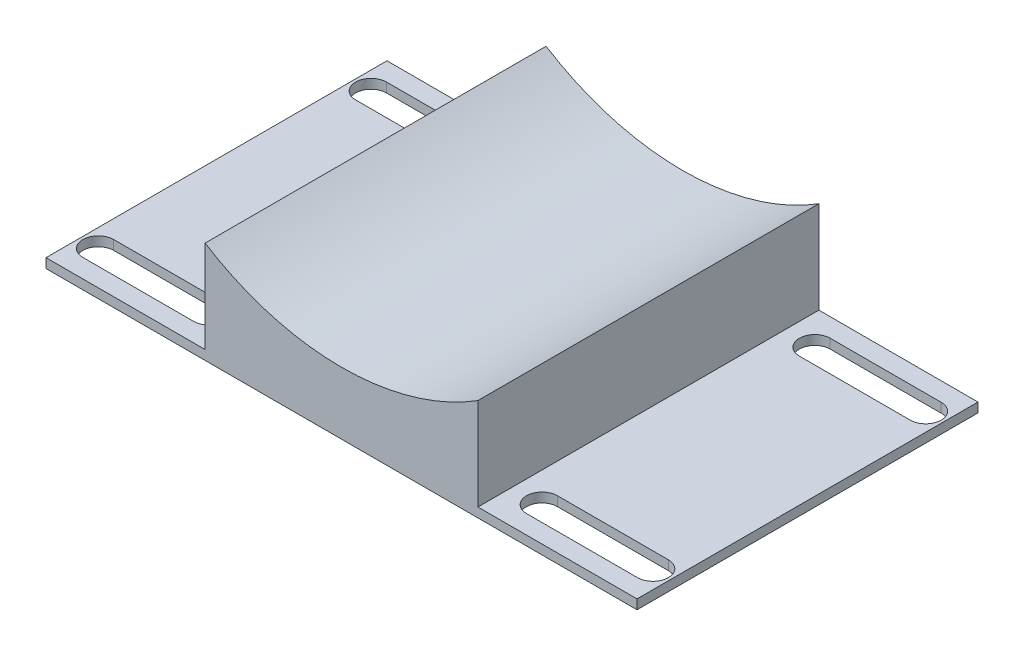
ISO-10303-21;
HEADER;
FILE_DESCRIPTION(('STEP AP214'),'2;1');
FILE_NAME('part.step','',(''),(''),'','','');
FILE_SCHEMA(('AUTOMOTIVE_DESIGN { 1 0 10303 214 1 1 1 1 }'));
ENDSEC;
DATA;
#1=APPLICATION_CONTEXT('core data for automotive mechanical design processes');
#2=APPLICATION_PROTOCOL_DEFINITION('international standard','automotive_design',2000,#1);
#3=PRODUCT_CONTEXT('',#1,'mechanical');
#4=PRODUCT('Part','Part','',(#3));
#5=PRODUCT_RELATED_PRODUCT_CATEGORY('part','',(#4));
#6=PRODUCT_DEFINITION_FORMATION('','',#4);
#7=PRODUCT_DEFINITION_CONTEXT('part definition',#1,'design');
#8=PRODUCT_DEFINITION('design','',#6,#7);
#9=PRODUCT_DEFINITION_SHAPE('','',#8);
#10=(LENGTH_UNIT() NAMED_UNIT(*) SI_UNIT(.MILLI.,.METRE.));
#11=(NAMED_UNIT(*) PLANE_ANGLE_UNIT() SI_UNIT($,.RADIAN.));
#12=(NAMED_UNIT(*) SI_UNIT($,.STERADIAN.) SOLID_ANGLE_UNIT());
#13=UNCERTAINTY_MEASURE_WITH_UNIT(LENGTH_MEASURE(1.E-05),#10,'distance_accuracy_value','');
#14=(GEOMETRIC_REPRESENTATION_CONTEXT(3) GLOBAL_UNCERTAINTY_ASSIGNED_CONTEXT((#13)) GLOBAL_UNIT_ASSIGNED_CONTEXT((#10,
#11,#12)) REPRESENTATION_CONTEXT('',''));
#15=CARTESIAN_POINT('',(0.,0.,0.));
#16=DIRECTION('',(0.,0.,1.));
#17=DIRECTION('',(1.,0.,0.));
#18=AXIS2_PLACEMENT_3D('',#15,#16,#17);
#19=CARTESIAN_POINT('',(38.1,1.32079999999999,95.25));
#20=DIRECTION('',(0.,-1.,0.));
#21=DIRECTION('',(1.,0.,0.));
#22=AXIS2_PLACEMENT_3D('',#19,#20,#21);
#23=PLANE('',#22);
#24=CARTESIAN_POINT('',(77.47,1.32079999999999,85.725));
#25=DIRECTION('',(0.,-1.,0.));
#26=DIRECTION('',(1.,0.,0.));
#27=AXIS2_PLACEMENT_3D('',#24,#25,#26);
#28=CIRCLE('',#27,4.31799999999999);
#29=CARTESIAN_POINT('',(77.47,1.32079999999999,81.4070000000001));
#30=VERTEX_POINT('',#29);
#31=CARTESIAN_POINT('',(77.47,1.32079999999999,90.043));
#32=VERTEX_POINT('',#31);
#33=EDGE_CURVE('E57',#30,#32,#28,.T.);
#34=ORIENTED_EDGE('',*,*,#33,.T.);
#35=DIRECTION('',(-1.,0.,0.));
#36=VECTOR('',#35,1.);
#37=CARTESIAN_POINT('',(77.47,1.32079999999999,90.043));
#38=LINE('',#37,#36);
#39=CARTESIAN_POINT('',(46.482,1.32079999999999,90.043));
#40=VERTEX_POINT('',#39);
#41=EDGE_CURVE('E233',#32,#40,#38,.T.);
#42=ORIENTED_EDGE('',*,*,#41,.T.);
#43=CARTESIAN_POINT('',(46.482,1.32079999999999,85.725));
#44=DIRECTION('',(0.,-1.,0.));
#45=DIRECTION('',(1.,0.,0.));
#46=AXIS2_PLACEMENT_3D('',#43,#44,#45);
#47=CIRCLE('',#46,4.31799999999999);
#48=CARTESIAN_POINT('',(46.482,1.32079999999999,81.4070000000001));
#49=VERTEX_POINT('',#48);
#50=EDGE_CURVE('E230',#40,#49,#47,.T.);
#51=ORIENTED_EDGE('',*,*,#50,.T.);
#52=DIRECTION('',(1.,0.,0.));
#53=VECTOR('',#52,1.);
#54=CARTESIAN_POINT('',(77.47,1.32079999999999,81.4070000000001));
#55=LINE('',#54,#53);
#56=EDGE_CURVE('E227',#49,#30,#55,.T.);
#57=ORIENTED_EDGE('',*,*,#56,.T.);
#58=EDGE_LOOP('',(#34,#42,#51,#57));
#59=FACE_BOUND('',#58,.T.);
#60=DIRECTION('',(-1.,0.,0.));
#61=VECTOR('',#60,1.);
#62=CARTESIAN_POINT('',(38.1,1.32079999999999,0.));
#63=LINE('',#62,#61);
#64=CARTESIAN_POINT('',(82.5499999999995,1.32079999999999,0.));
#65=VERTEX_POINT('',#64);
#66=CARTESIAN_POINT('',(38.1,1.32079999999999,0.));
#67=VERTEX_POINT('',#66);
#68=EDGE_CURVE('E305',#65,#67,#63,.T.);
#69=ORIENTED_EDGE('',*,*,#68,.T.);
#70=DIRECTION('',(0.,0.,-1.));
#71=VECTOR('',#70,1.);
#72=CARTESIAN_POINT('',(38.1,1.32079999999999,95.25));
#73=LINE('',#72,#71);
#74=CARTESIAN_POINT('',(38.1,1.32079999999999,95.25));
#75=VERTEX_POINT('',#74);
#76=EDGE_CURVE('E335',#75,#67,#73,.T.);
#77=ORIENTED_EDGE('',*,*,#76,.F.);
#78=DIRECTION('',(-1.,0.,0.));
#79=VECTOR('',#78,1.);
#80=CARTESIAN_POINT('',(38.1,1.32079999999999,95.25));
#81=LINE('',#80,#79);
#82=CARTESIAN_POINT('',(82.5499999999995,1.32079999999999,95.25));
#83=VERTEX_POINT('',#82);
#84=EDGE_CURVE('E287',#83,#75,#81,.T.);
#85=ORIENTED_EDGE('',*,*,#84,.F.);
#86=DIRECTION('',(0.,0.,-1.));
#87=VECTOR('',#86,1.);
#88=CARTESIAN_POINT('',(82.5499999999995,1.32079999999999,95.25));
#89=LINE('',#88,#87);
#90=EDGE_CURVE('E338',#83,#65,#89,.T.);
#91=ORIENTED_EDGE('',*,*,#90,.T.);
#92=EDGE_LOOP('',(#69,#77,#85,#91));
#93=FACE_BOUND('',#92,.T.);
#94=CARTESIAN_POINT('',(77.47,1.32079999999999,9.52500000000001));
#95=DIRECTION('',(0.,-1.,0.));
#96=DIRECTION('',(1.,0.,0.));
#97=AXIS2_PLACEMENT_3D('',#94,#95,#96);
#98=CIRCLE('',#97,4.318);
#99=CARTESIAN_POINT('',(77.47,1.32079999999999,5.20700000000002));
#100=VERTEX_POINT('',#99);
#101=CARTESIAN_POINT('',(77.47,1.32079999999999,13.843));
#102=VERTEX_POINT('',#101);
#103=EDGE_CURVE('E49',#100,#102,#98,.T.);
#104=ORIENTED_EDGE('',*,*,#103,.T.);
#105=DIRECTION('',(-1.,0.,0.));
#106=VECTOR('',#105,1.);
#107=CARTESIAN_POINT('',(77.47,1.32079999999999,13.843));
#108=LINE('',#107,#106);
#109=CARTESIAN_POINT('',(46.482,1.32079999999999,13.843));
#110=VERTEX_POINT('',#109);
#111=EDGE_CURVE('E216',#102,#110,#108,.T.);
#112=ORIENTED_EDGE('',*,*,#111,.T.);
#113=CARTESIAN_POINT('',(46.482,1.32079999999999,9.52500000000001));
#114=DIRECTION('',(0.,-1.,0.));
#115=DIRECTION('',(1.,0.,0.));
#116=AXIS2_PLACEMENT_3D('',#113,#114,#115);
#117=CIRCLE('',#116,4.318);
#118=CARTESIAN_POINT('',(46.482,1.32079999999999,5.20700000000001));
#119=VERTEX_POINT('',#118);
#120=EDGE_CURVE('E201',#110,#119,#117,.T.);
#121=ORIENTED_EDGE('',*,*,#120,.T.);
#122=DIRECTION('',(1.,0.,0.));
#123=VECTOR('',#122,1.);
#124=CARTESIAN_POINT('',(77.47,1.32079999999999,5.20700000000001));
#125=LINE('',#124,#123);
#126=EDGE_CURVE('E211',#119,#100,#125,.T.);
#127=ORIENTED_EDGE('',*,*,#126,.T.);
#128=EDGE_LOOP('',(#104,#112,#121,#127));
#129=FACE_BOUND('',#128,.T.);
#130=ADVANCED_FACE('F34',(#59,#93,#129),#23,.F.);
#131=CARTESIAN_POINT('',(-82.5500000000005,-1.32080000000001,95.25));
#132=DIRECTION('',(0.,1.,0.));
#133=DIRECTION('',(0.,0.,1.));
#134=AXIS2_PLACEMENT_3D('',#131,#132,#133);
#135=PLANE('',#134);
#136=CARTESIAN_POINT('',(77.47,-1.32080000000001,85.725));
#137=DIRECTION('',(0.,1.,0.));
#138=DIRECTION('',(0.,0.,1.));
#139=AXIS2_PLACEMENT_3D('',#136,#137,#138);
#140=CIRCLE('',#139,4.31799999999999);
#141=CARTESIAN_POINT('',(77.47,-1.32080000000001,81.4070000000001));
#142=VERTEX_POINT('',#141);
#143=CARTESIAN_POINT('',(77.47,-1.32080000000001,90.043));
#144=VERTEX_POINT('',#143);
#145=EDGE_CURVE('E372',#142,#144,#140,.F.);
#146=ORIENTED_EDGE('',*,*,#145,.F.);
#147=DIRECTION('',(1.,0.,0.));
#148=VECTOR('',#147,1.);
#149=CARTESIAN_POINT('',(-82.5500000000005,-1.32080000000001,81.4070000000001));
#150=LINE('',#149,#148);
#151=CARTESIAN_POINT('',(46.482,-1.32080000000001,81.4070000000001));
#152=VERTEX_POINT('',#151);
#153=EDGE_CURVE('E365',#152,#142,#150,.T.);
#154=ORIENTED_EDGE('',*,*,#153,.F.);
#155=CARTESIAN_POINT('',(46.482,-1.32080000000001,85.725));
#156=DIRECTION('',(0.,1.,0.));
#157=DIRECTION('',(0.,0.,1.));
#158=AXIS2_PLACEMENT_3D('',#155,#156,#157);
#159=CIRCLE('',#158,4.31799999999999);
#160=CARTESIAN_POINT('',(46.482,-1.32080000000001,90.043));
#161=VERTEX_POINT('',#160);
#162=EDGE_CURVE('E367',#161,#152,#159,.F.);
#163=ORIENTED_EDGE('',*,*,#162,.F.);
#164=DIRECTION('',(-1.,0.,0.));
#165=VECTOR('',#164,1.);
#166=CARTESIAN_POINT('',(-82.5500000000005,-1.32080000000001,90.043));
#167=LINE('',#166,#165);
#168=EDGE_CURVE('E370',#144,#161,#167,.T.);
#169=ORIENTED_EDGE('',*,*,#168,.F.);
#170=EDGE_LOOP('',(#146,#154,#163,#169));
#171=FACE_BOUND('',#170,.T.);
#172=DIRECTION('',(-1.,0.,0.));
#173=VECTOR('',#172,1.);
#174=CARTESIAN_POINT('',(-82.5500000000005,-1.32080000000001,5.20700000000002));
#175=LINE('',#174,#173);
#176=CARTESIAN_POINT('',(-46.482,-1.32080000000001,5.20700000000001));
#177=VERTEX_POINT('',#176);
#178=CARTESIAN_POINT('',(-77.47,-1.32080000000001,5.20700000000001));
#179=VERTEX_POINT('',#178);
#180=EDGE_CURVE('E359',#177,#179,#175,.T.);
#181=ORIENTED_EDGE('',*,*,#180,.T.);
#182=CARTESIAN_POINT('',(-77.47,-1.32080000000001,9.52500000000001));
#183=DIRECTION('',(0.,1.,0.));
#184=DIRECTION('',(0.,0.,1.));
#185=AXIS2_PLACEMENT_3D('',#182,#183,#184);
#186=CIRCLE('',#185,4.318);
#187=CARTESIAN_POINT('',(-77.47,-1.32080000000001,13.843));
#188=VERTEX_POINT('',#187);
#189=EDGE_CURVE('E362',#179,#188,#186,.T.);
#190=ORIENTED_EDGE('',*,*,#189,.T.);
#191=DIRECTION('',(1.,0.,0.));
#192=VECTOR('',#191,1.);
#193=CARTESIAN_POINT('',(-82.5500000000005,-1.32080000000001,13.843));
#194=LINE('',#193,#192);
#195=CARTESIAN_POINT('',(-46.482,-1.32080000000001,13.843));
#196=VERTEX_POINT('',#195);
#197=EDGE_CURVE('E353',#188,#196,#194,.T.);
#198=ORIENTED_EDGE('',*,*,#197,.T.);
#199=CARTESIAN_POINT('',(-46.482,-1.32080000000001,9.52500000000001));
#200=DIRECTION('',(0.,1.,0.));
#201=DIRECTION('',(0.,0.,1.));
#202=AXIS2_PLACEMENT_3D('',#199,#200,#201);
#203=CIRCLE('',#202,4.318);
#204=EDGE_CURVE('E356',#196,#177,#203,.T.);
#205=ORIENTED_EDGE('',*,*,#204,.T.);
#206=EDGE_LOOP('',(#181,#190,#198,#205));
#207=FACE_BOUND('',#206,.T.);
#208=DIRECTION('',(-1.,0.,0.));
#209=VECTOR('',#208,1.);
#210=CARTESIAN_POINT('',(-82.5500000000005,-1.32080000000001,81.4070000000001));
#211=LINE('',#210,#209);
#212=CARTESIAN_POINT('',(-46.482,-1.32080000000001,81.4070000000001));
#213=VERTEX_POINT('',#212);
#214=CARTESIAN_POINT('',(-77.47,-1.32080000000001,81.4070000000001));
#215=VERTEX_POINT('',#214);
#216=EDGE_CURVE('E347',#213,#215,#211,.T.);
#217=ORIENTED_EDGE('',*,*,#216,.T.);
#218=CARTESIAN_POINT('',(-77.47,-1.32080000000001,85.725));
#219=DIRECTION('',(0.,1.,0.));
#220=DIRECTION('',(0.,0.,1.));
#221=AXIS2_PLACEMENT_3D('',#218,#219,#220);
#222=CIRCLE('',#221,4.31799999999999);
#223=CARTESIAN_POINT('',(-77.47,-1.32080000000001,90.043));
#224=VERTEX_POINT('',#223);
#225=EDGE_CURVE('E350',#215,#224,#222,.T.);
#226=ORIENTED_EDGE('',*,*,#225,.T.);
#227=DIRECTION('',(1.,0.,0.));
#228=VECTOR('',#227,1.);
#229=CARTESIAN_POINT('',(-82.5500000000005,-1.32080000000001,90.043));
#230=LINE('',#229,#228);
#231=CARTESIAN_POINT('',(-46.482,-1.32080000000001,90.043));
#232=VERTEX_POINT('',#231);
#233=EDGE_CURVE('E341',#224,#232,#230,.T.);
#234=ORIENTED_EDGE('',*,*,#233,.T.);
#235=CARTESIAN_POINT('',(-46.482,-1.32080000000001,85.725));
#236=DIRECTION('',(0.,1.,0.));
#237=DIRECTION('',(0.,0.,1.));
#238=AXIS2_PLACEMENT_3D('',#235,#236,#237);
#239=CIRCLE('',#238,4.31799999999999);
#240=EDGE_CURVE('E344',#232,#213,#239,.T.);
#241=ORIENTED_EDGE('',*,*,#240,.T.);
#242=EDGE_LOOP('',(#217,#226,#234,#241));
#243=FACE_BOUND('',#242,.T.);
#244=DIRECTION('',(1.,0.,0.));
#245=VECTOR('',#244,1.);
#246=CARTESIAN_POINT('',(-82.5500000000005,-1.32080000000001,0.));
#247=LINE('',#246,#245);
#248=CARTESIAN_POINT('',(-82.5500000000005,-1.32080000000001,0.));
#249=VERTEX_POINT('',#248);
#250=CARTESIAN_POINT('',(82.5499999999995,-1.32080000000001,0.));
#251=VERTEX_POINT('',#250);
#252=EDGE_CURVE('E288',#249,#251,#247,.T.);
#253=ORIENTED_EDGE('',*,*,#252,.T.);
#254=DIRECTION('',(0.,0.,-1.));
#255=VECTOR('',#254,1.);
#256=CARTESIAN_POINT('',(82.5499999999995,-1.32080000000001,95.25));
#257=LINE('',#256,#255);
#258=CARTESIAN_POINT('',(82.5499999999995,-1.32080000000001,95.25));
#259=VERTEX_POINT('',#258);
#260=EDGE_CURVE('E302',#259,#251,#257,.T.);
#261=ORIENTED_EDGE('',*,*,#260,.F.);
#262=DIRECTION('',(1.,0.,0.));
#263=VECTOR('',#262,1.);
#264=CARTESIAN_POINT('',(-82.5500000000005,-1.32080000000001,95.25));
#265=LINE('',#264,#263);
#266=CARTESIAN_POINT('',(-82.5500000000005,-1.32080000000001,95.25));
#267=VERTEX_POINT('',#266);
#268=EDGE_CURVE('E300',#267,#259,#265,.T.);
#269=ORIENTED_EDGE('',*,*,#268,.F.);
#270=DIRECTION('',(0.,0.,-1.));
#271=VECTOR('',#270,1.);
#272=CARTESIAN_POINT('',(-82.5500000000005,-1.32080000000001,95.25));
#273=LINE('',#272,#271);
#274=EDGE_CURVE('E320',#267,#249,#273,.T.);
#275=ORIENTED_EDGE('',*,*,#274,.T.);
#276=EDGE_LOOP('',(#253,#261,#269,#275));
#277=FACE_BOUND('',#276,.T.);
#278=CARTESIAN_POINT('',(77.47,-1.32080000000001,9.52500000000001));
#279=DIRECTION('',(0.,1.,0.));
#280=DIRECTION('',(0.,0.,1.));
#281=AXIS2_PLACEMENT_3D('',#278,#279,#280);
#282=CIRCLE('',#281,4.318);
#283=CARTESIAN_POINT('',(77.47,-1.32080000000001,5.20700000000001));
#284=VERTEX_POINT('',#283);
#285=CARTESIAN_POINT('',(77.47,-1.32080000000001,13.843));
#286=VERTEX_POINT('',#285);
#287=EDGE_CURVE('E11',#284,#286,#282,.F.);
#288=ORIENTED_EDGE('',*,*,#287,.F.);
#289=DIRECTION('',(1.,0.,0.));
#290=VECTOR('',#289,1.);
#291=CARTESIAN_POINT('',(-82.5500000000004,-1.32080000000001,5.207));
#292=LINE('',#291,#290);
#293=CARTESIAN_POINT('',(46.482,-1.32080000000001,5.20700000000002));
#294=VERTEX_POINT('',#293);
#295=EDGE_CURVE('E374',#294,#284,#292,.T.);
#296=ORIENTED_EDGE('',*,*,#295,.F.);
#297=CARTESIAN_POINT('',(46.482,-1.32080000000001,9.52500000000001));
#298=DIRECTION('',(0.,1.,0.));
#299=DIRECTION('',(0.,0.,1.));
#300=AXIS2_PLACEMENT_3D('',#297,#298,#299);
#301=CIRCLE('',#300,4.318);
#302=CARTESIAN_POINT('',(46.482,-1.32080000000001,13.843));
#303=VERTEX_POINT('',#302);
#304=EDGE_CURVE('E204',#303,#294,#301,.F.);
#305=ORIENTED_EDGE('',*,*,#304,.F.);
#306=DIRECTION('',(-1.,0.,0.));
#307=VECTOR('',#306,1.);
#308=CARTESIAN_POINT('',(-82.5500000000004,-1.32080000000001,13.843));
#309=LINE('',#308,#307);
#310=EDGE_CURVE('E42',#286,#303,#309,.T.);
#311=ORIENTED_EDGE('',*,*,#310,.F.);
#312=EDGE_LOOP('',(#288,#296,#305,#311));
#313=FACE_BOUND('',#312,.T.);
#314=ADVANCED_FACE('F382',(#171,#207,#243,#277,#313),#135,.F.);
#315=CARTESIAN_POINT('',(82.5499999999995,1.32079999999999,95.25));
#316=DIRECTION('',(-1.,0.,0.));
#317=DIRECTION('',(0.,0.,1.));
#318=AXIS2_PLACEMENT_3D('',#315,#316,#317);
#319=PLANE('',#318);
#320=DIRECTION('',(0.,1.,0.));
#321=VECTOR('',#320,1.);
#322=CARTESIAN_POINT('',(82.5499999999995,1.32079999999999,0.));
#323=LINE('',#322,#321);
#324=EDGE_CURVE('E259',#251,#65,#323,.T.);
#325=ORIENTED_EDGE('',*,*,#324,.T.);
#326=ORIENTED_EDGE('',*,*,#90,.F.);
#327=DIRECTION('',(0.,1.,0.));
#328=VECTOR('',#327,1.);
#329=CARTESIAN_POINT('',(82.5499999999995,1.32079999999999,95.25));
#330=LINE('',#329,#328);
#331=EDGE_CURVE('E284',#259,#83,#330,.T.);
#332=ORIENTED_EDGE('',*,*,#331,.F.);
#333=ORIENTED_EDGE('',*,*,#260,.T.);
#334=EDGE_LOOP('',(#325,#326,#332,#333));
#335=FACE_BOUND('',#334,.T.);
#336=ADVANCED_FACE('F36',(#335),#319,.F.);
#337=CARTESIAN_POINT('',(38.1,27.0747951934076,95.25));
#338=DIRECTION('',(-1.,0.,0.));
#339=DIRECTION('',(0.,-1.,0.));
#340=AXIS2_PLACEMENT_3D('',#337,#338,#339);
#341=PLANE('',#340);
#342=DIRECTION('',(0.,1.,0.));
#343=VECTOR('',#342,1.);
#344=CARTESIAN_POINT('',(38.1,27.0747951934076,0.));
#345=LINE('',#344,#343);
#346=CARTESIAN_POINT('',(38.1,27.0747951934076,0.));
#347=VERTEX_POINT('',#346);
#348=EDGE_CURVE('E307',#67,#347,#345,.T.);
#349=ORIENTED_EDGE('',*,*,#348,.T.);
#350=DIRECTION('',(0.,0.,-1.));
#351=VECTOR('',#350,1.);
#352=CARTESIAN_POINT('',(38.1,27.0747951934076,95.25));
#353=LINE('',#352,#351);
#354=CARTESIAN_POINT('',(38.1,27.0747951934076,95.25));
#355=VERTEX_POINT('',#354);
#356=EDGE_CURVE('E332',#355,#347,#353,.T.);
#357=ORIENTED_EDGE('',*,*,#356,.F.);
#358=DIRECTION('',(0.,1.,0.));
#359=VECTOR('',#358,1.);
#360=CARTESIAN_POINT('',(38.1,27.0747951934076,95.25));
#361=LINE('',#360,#359);
#362=EDGE_CURVE('E290',#75,#355,#361,.T.);
#363=ORIENTED_EDGE('',*,*,#362,.F.);
#364=ORIENTED_EDGE('',*,*,#76,.T.);
#365=EDGE_LOOP('',(#349,#357,#363,#364));
#366=FACE_BOUND('',#365,.T.);
#367=ADVANCED_FACE('F406',(#366),#341,.F.);
#368=CARTESIAN_POINT('',(0.,87.5792,95.25));
#369=DIRECTION('',(0.,0.,-1.));
#370=DIRECTION('',(-1.,0.,0.));
#371=AXIS2_PLACEMENT_3D('',#368,#369,#370);
#372=CYLINDRICAL_SURFACE('',#371,71.501);
#373=CARTESIAN_POINT('',(0.,87.5792,0.));
#374=DIRECTION('',(0.,0.,-1.));
#375=DIRECTION('',(1.,0.,0.));
#376=AXIS2_PLACEMENT_3D('',#373,#374,#375);
#377=CIRCLE('',#376,71.501);
#378=CARTESIAN_POINT('',(-38.1,27.0747951934076,0.));
#379=VERTEX_POINT('',#378);
#380=EDGE_CURVE('E309',#347,#379,#377,.T.);
#381=ORIENTED_EDGE('',*,*,#380,.T.);
#382=DIRECTION('',(0.,0.,-1.));
#383=VECTOR('',#382,1.);
#384=CARTESIAN_POINT('',(-38.1,27.0747951934076,95.25));
#385=LINE('',#384,#383);
#386=CARTESIAN_POINT('',(-38.1,27.0747951934076,95.25));
#387=VERTEX_POINT('',#386);
#388=EDGE_CURVE('E329',#387,#379,#385,.T.);
#389=ORIENTED_EDGE('',*,*,#388,.F.);
#390=CARTESIAN_POINT('',(0.,87.5792,95.25));
#391=DIRECTION('',(0.,0.,-1.));
#392=DIRECTION('',(1.,0.,0.));
#393=AXIS2_PLACEMENT_3D('',#390,#391,#392);
#394=CIRCLE('',#393,71.501);
#395=EDGE_CURVE('E292',#355,#387,#394,.T.);
#396=ORIENTED_EDGE('',*,*,#395,.F.);
#397=ORIENTED_EDGE('',*,*,#356,.T.);
#398=EDGE_LOOP('',(#381,#389,#396,#397));
#399=FACE_BOUND('',#398,.T.);
#400=ADVANCED_FACE('F409',(#399),#372,.F.);
#401=CARTESIAN_POINT('',(-38.1,27.0747951934076,95.25));
#402=DIRECTION('',(1.,0.,0.));
#403=DIRECTION('',(0.,1.,0.));
#404=AXIS2_PLACEMENT_3D('',#401,#402,#403);
#405=PLANE('',#404);
#406=DIRECTION('',(0.,-1.,0.));
#407=VECTOR('',#406,1.);
#408=CARTESIAN_POINT('',(-38.1,27.0747951934076,0.));
#409=LINE('',#408,#407);
#410=CARTESIAN_POINT('',(-38.1,1.32079999999999,0.));
#411=VERTEX_POINT('',#410);
#412=EDGE_CURVE('E311',#379,#411,#409,.T.);
#413=ORIENTED_EDGE('',*,*,#412,.T.);
#414=DIRECTION('',(0.,0.,-1.));
#415=VECTOR('',#414,1.);
#416=CARTESIAN_POINT('',(-38.1,1.32079999999999,95.25));
#417=LINE('',#416,#415);
#418=CARTESIAN_POINT('',(-38.1,1.32079999999999,95.25));
#419=VERTEX_POINT('',#418);
#420=EDGE_CURVE('E326',#419,#411,#417,.T.);
#421=ORIENTED_EDGE('',*,*,#420,.F.);
#422=DIRECTION('',(0.,-1.,0.));
#423=VECTOR('',#422,1.);
#424=CARTESIAN_POINT('',(-38.1,27.0747951934076,95.25));
#425=LINE('',#424,#423);
#426=EDGE_CURVE('E294',#387,#419,#425,.T.);
#427=ORIENTED_EDGE('',*,*,#426,.F.);
#428=ORIENTED_EDGE('',*,*,#388,.T.);
#429=EDGE_LOOP('',(#413,#421,#427,#428));
#430=FACE_BOUND('',#429,.T.);
#431=ADVANCED_FACE('F413',(#430),#405,.F.);
#432=CARTESIAN_POINT('',(-82.5500000000005,1.32079999999999,95.25));
#433=DIRECTION('',(0.,-1.,0.));
#434=DIRECTION('',(1.,0.,0.));
#435=AXIS2_PLACEMENT_3D('',#432,#433,#434);
#436=PLANE('',#435);
#437=DIRECTION('',(1.,0.,0.));
#438=VECTOR('',#437,1.);
#439=CARTESIAN_POINT('',(-77.47,1.32079999999999,13.843));
#440=LINE('',#439,#438);
#441=CARTESIAN_POINT('',(-77.47,1.32079999999999,13.843));
#442=VERTEX_POINT('',#441);
#443=CARTESIAN_POINT('',(-46.482,1.32079999999999,13.843));
#444=VERTEX_POINT('',#443);
#445=EDGE_CURVE('E246',#442,#444,#440,.T.);
#446=ORIENTED_EDGE('',*,*,#445,.F.);
#447=CARTESIAN_POINT('',(-77.47,1.32079999999999,9.52500000000001));
#448=DIRECTION('',(0.,1.,0.));
#449=DIRECTION('',(-1.,0.,0.));
#450=AXIS2_PLACEMENT_3D('',#447,#448,#449);
#451=CIRCLE('',#450,4.318);
#452=CARTESIAN_POINT('',(-77.47,1.32079999999999,5.20700000000001));
#453=VERTEX_POINT('',#452);
#454=EDGE_CURVE('E244',#453,#442,#451,.T.);
#455=ORIENTED_EDGE('',*,*,#454,.F.);
#456=DIRECTION('',(-1.,0.,0.));
#457=VECTOR('',#456,1.);
#458=CARTESIAN_POINT('',(-77.47,1.32079999999999,5.20700000000001));
#459=LINE('',#458,#457);
#460=CARTESIAN_POINT('',(-46.482,1.32079999999999,5.20700000000001));
#461=VERTEX_POINT('',#460);
#462=EDGE_CURVE('E253',#461,#453,#459,.T.);
#463=ORIENTED_EDGE('',*,*,#462,.F.);
#464=CARTESIAN_POINT('',(-46.482,1.32079999999999,9.52500000000001));
#465=DIRECTION('',(0.,1.,0.));
#466=DIRECTION('',(-1.,0.,0.));
#467=AXIS2_PLACEMENT_3D('',#464,#465,#466);
#468=CIRCLE('',#467,4.318);
#469=EDGE_CURVE('E250',#444,#461,#468,.T.);
#470=ORIENTED_EDGE('',*,*,#469,.F.);
#471=EDGE_LOOP('',(#446,#455,#463,#470));
#472=FACE_BOUND('',#471,.T.);
#473=DIRECTION('',(1.,0.,0.));
#474=VECTOR('',#473,1.);
#475=CARTESIAN_POINT('',(-77.47,1.32079999999999,90.043));
#476=LINE('',#475,#474);
#477=CARTESIAN_POINT('',(-77.47,1.32079999999999,90.043));
#478=VERTEX_POINT('',#477);
#479=CARTESIAN_POINT('',(-46.482,1.32079999999999,90.043));
#480=VERTEX_POINT('',#479);
#481=EDGE_CURVE('E267',#478,#480,#476,.T.);
#482=ORIENTED_EDGE('',*,*,#481,.F.);
#483=CARTESIAN_POINT('',(-77.47,1.32079999999999,85.725));
#484=DIRECTION('',(0.,1.,0.));
#485=DIRECTION('',(-1.,0.,0.));
#486=AXIS2_PLACEMENT_3D('',#483,#484,#485);
#487=CIRCLE('',#486,4.31799999999999);
#488=CARTESIAN_POINT('',(-77.47,1.32079999999999,81.4070000000001));
#489=VERTEX_POINT('',#488);
#490=EDGE_CURVE('E223',#489,#478,#487,.T.);
#491=ORIENTED_EDGE('',*,*,#490,.F.);
#492=DIRECTION('',(-1.,0.,0.));
#493=VECTOR('',#492,1.);
#494=CARTESIAN_POINT('',(-77.47,1.32079999999999,81.4070000000001));
#495=LINE('',#494,#493);
#496=CARTESIAN_POINT('',(-46.482,1.32079999999999,81.4070000000001));
#497=VERTEX_POINT('',#496);
#498=EDGE_CURVE('E273',#497,#489,#495,.T.);
#499=ORIENTED_EDGE('',*,*,#498,.F.);
#500=CARTESIAN_POINT('',(-46.482,1.32079999999999,85.725));
#501=DIRECTION('',(0.,1.,0.));
#502=DIRECTION('',(-1.,0.,0.));
#503=AXIS2_PLACEMENT_3D('',#500,#501,#502);
#504=CIRCLE('',#503,4.31799999999999);
#505=EDGE_CURVE('E270',#480,#497,#504,.T.);
#506=ORIENTED_EDGE('',*,*,#505,.F.);
#507=EDGE_LOOP('',(#482,#491,#499,#506));
#508=FACE_BOUND('',#507,.T.);
#509=DIRECTION('',(-1.,0.,0.));
#510=VECTOR('',#509,1.);
#511=CARTESIAN_POINT('',(-82.5500000000005,1.32079999999999,0.));
#512=LINE('',#511,#510);
#513=CARTESIAN_POINT('',(-82.5500000000005,1.32079999999999,0.));
#514=VERTEX_POINT('',#513);
#515=EDGE_CURVE('E313',#411,#514,#512,.T.);
#516=ORIENTED_EDGE('',*,*,#515,.T.);
#517=DIRECTION('',(0.,0.,-1.));
#518=VECTOR('',#517,1.);
#519=CARTESIAN_POINT('',(-82.5500000000005,1.32079999999999,95.25));
#520=LINE('',#519,#518);
#521=CARTESIAN_POINT('',(-82.5500000000005,1.32079999999999,95.25));
#522=VERTEX_POINT('',#521);
#523=EDGE_CURVE('E323',#522,#514,#520,.T.);
#524=ORIENTED_EDGE('',*,*,#523,.F.);
#525=DIRECTION('',(-1.,0.,0.));
#526=VECTOR('',#525,1.);
#527=CARTESIAN_POINT('',(-82.5500000000005,1.32079999999999,95.25));
#528=LINE('',#527,#526);
#529=EDGE_CURVE('E296',#419,#522,#528,.T.);
#530=ORIENTED_EDGE('',*,*,#529,.F.);
#531=ORIENTED_EDGE('',*,*,#420,.T.);
#532=EDGE_LOOP('',(#516,#524,#530,#531));
#533=FACE_BOUND('',#532,.T.);
#534=ADVANCED_FACE('F417',(#472,#508,#533),#436,.F.);
#535=CARTESIAN_POINT('',(-82.5500000000005,1.32079999999999,95.25));
#536=DIRECTION('',(1.,0.,0.));
#537=DIRECTION('',(0.,0.,-1.));
#538=AXIS2_PLACEMENT_3D('',#535,#536,#537);
#539=PLANE('',#538);
#540=DIRECTION('',(0.,-1.,0.));
#541=VECTOR('',#540,1.);
#542=CARTESIAN_POINT('',(-82.5500000000005,1.32079999999999,0.));
#543=LINE('',#542,#541);
#544=EDGE_CURVE('E315',#514,#249,#543,.T.);
#545=ORIENTED_EDGE('',*,*,#544,.T.);
#546=ORIENTED_EDGE('',*,*,#274,.F.);
#547=DIRECTION('',(0.,-1.,0.));
#548=VECTOR('',#547,1.);
#549=CARTESIAN_POINT('',(-82.5500000000005,1.32079999999999,95.25));
#550=LINE('',#549,#548);
#551=EDGE_CURVE('E298',#522,#267,#550,.T.);
#552=ORIENTED_EDGE('',*,*,#551,.F.);
#553=ORIENTED_EDGE('',*,*,#523,.T.);
#554=EDGE_LOOP('',(#545,#546,#552,#553));
#555=FACE_BOUND('',#554,.T.);
#556=ADVANCED_FACE('F421',(#555),#539,.F.);
#557=CARTESIAN_POINT('',(0.,87.5792,95.25));
#558=DIRECTION('',(0.,0.,1.));
#559=DIRECTION('',(1.,0.,0.));
#560=AXIS2_PLACEMENT_3D('',#557,#558,#559);
#561=PLANE('',#560);
#562=ORIENTED_EDGE('',*,*,#331,.T.);
#563=ORIENTED_EDGE('',*,*,#84,.T.);
#564=ORIENTED_EDGE('',*,*,#362,.T.);
#565=ORIENTED_EDGE('',*,*,#395,.T.);
#566=ORIENTED_EDGE('',*,*,#426,.T.);
#567=ORIENTED_EDGE('',*,*,#529,.T.);
#568=ORIENTED_EDGE('',*,*,#551,.T.);
#569=ORIENTED_EDGE('',*,*,#268,.T.);
#570=EDGE_LOOP('',(#562,#563,#564,#565,#566,#567,#568,#569));
#571=FACE_BOUND('',#570,.T.);
#572=ADVANCED_FACE('F424',(#571),#561,.T.);
#573=CARTESIAN_POINT('',(0.,87.5792,0.));
#574=DIRECTION('',(0.,0.,1.));
#575=DIRECTION('',(1.,0.,0.));
#576=AXIS2_PLACEMENT_3D('',#573,#574,#575);
#577=PLANE('',#576);
#578=ORIENTED_EDGE('',*,*,#324,.F.);
#579=ORIENTED_EDGE('',*,*,#252,.F.);
#580=ORIENTED_EDGE('',*,*,#544,.F.);
#581=ORIENTED_EDGE('',*,*,#515,.F.);
#582=ORIENTED_EDGE('',*,*,#412,.F.);
#583=ORIENTED_EDGE('',*,*,#380,.F.);
#584=ORIENTED_EDGE('',*,*,#348,.F.);
#585=ORIENTED_EDGE('',*,*,#68,.F.);
#586=EDGE_LOOP('',(#578,#579,#580,#581,#582,#583,#584,#585));
#587=FACE_BOUND('',#586,.T.);
#588=ADVANCED_FACE('F427',(#587),#577,.F.);
#589=CARTESIAN_POINT('',(-77.47,-93.9292,85.725));
#590=DIRECTION('',(0.,1.,0.));
#591=DIRECTION('',(-1.,0.,0.));
#592=AXIS2_PLACEMENT_3D('',#589,#590,#591);
#593=CYLINDRICAL_SURFACE('',#592,4.31799999999999);
#594=DIRECTION('',(0.,1.,0.));
#595=VECTOR('',#594,1.);
#596=CARTESIAN_POINT('',(-77.47,-93.9292,81.4070000000001));
#597=LINE('',#596,#595);
#598=EDGE_CURVE('E247',#215,#489,#597,.T.);
#599=ORIENTED_EDGE('',*,*,#598,.T.);
#600=ORIENTED_EDGE('',*,*,#490,.T.);
#601=DIRECTION('',(0.,1.,0.));
#602=VECTOR('',#601,1.);
#603=CARTESIAN_POINT('',(-77.47,-93.9292,90.043));
#604=LINE('',#603,#602);
#605=EDGE_CURVE('E276',#224,#478,#604,.T.);
#606=ORIENTED_EDGE('',*,*,#605,.F.);
#607=ORIENTED_EDGE('',*,*,#225,.F.);
#608=EDGE_LOOP('',(#599,#600,#606,#607));
#609=FACE_BOUND('',#608,.T.);
#610=ADVANCED_FACE('F430',(#609),#593,.F.);
#611=CARTESIAN_POINT('',(-77.47,-93.9292,81.4070000000001));
#612=DIRECTION('',(0.,0.,-1.));
#613=DIRECTION('',(-1.,0.,0.));
#614=AXIS2_PLACEMENT_3D('',#611,#612,#613);
#615=PLANE('',#614);
#616=DIRECTION('',(0.,1.,0.));
#617=VECTOR('',#616,1.);
#618=CARTESIAN_POINT('',(-46.482,-93.9292,81.4070000000001));
#619=LINE('',#618,#617);
#620=EDGE_CURVE('E278',#213,#497,#619,.T.);
#621=ORIENTED_EDGE('',*,*,#620,.T.);
#622=ORIENTED_EDGE('',*,*,#498,.T.);
#623=ORIENTED_EDGE('',*,*,#598,.F.);
#624=ORIENTED_EDGE('',*,*,#216,.F.);
#625=EDGE_LOOP('',(#621,#622,#623,#624));
#626=FACE_BOUND('',#625,.T.);
#627=ADVANCED_FACE('F437',(#626),#615,.F.);
#628=CARTESIAN_POINT('',(-46.482,-93.9292,85.725));
#629=DIRECTION('',(0.,1.,0.));
#630=DIRECTION('',(-1.,0.,0.));
#631=AXIS2_PLACEMENT_3D('',#628,#629,#630);
#632=CYLINDRICAL_SURFACE('',#631,4.31799999999999);
#633=DIRECTION('',(0.,1.,0.));
#634=VECTOR('',#633,1.);
#635=CARTESIAN_POINT('',(-46.482,-93.9292,90.043));
#636=LINE('',#635,#634);
#637=EDGE_CURVE('E280',#232,#480,#636,.T.);
#638=ORIENTED_EDGE('',*,*,#637,.T.);
#639=ORIENTED_EDGE('',*,*,#505,.T.);
#640=ORIENTED_EDGE('',*,*,#620,.F.);
#641=ORIENTED_EDGE('',*,*,#240,.F.);
#642=EDGE_LOOP('',(#638,#639,#640,#641));
#643=FACE_BOUND('',#642,.T.);
#644=ADVANCED_FACE('F443',(#643),#632,.F.);
#645=CARTESIAN_POINT('',(-77.47,-93.9292,90.043));
#646=DIRECTION('',(0.,0.,1.));
#647=DIRECTION('',(1.,0.,0.));
#648=AXIS2_PLACEMENT_3D('',#645,#646,#647);
#649=PLANE('',#648);
#650=ORIENTED_EDGE('',*,*,#605,.T.);
#651=ORIENTED_EDGE('',*,*,#481,.T.);
#652=ORIENTED_EDGE('',*,*,#637,.F.);
#653=ORIENTED_EDGE('',*,*,#233,.F.);
#654=EDGE_LOOP('',(#650,#651,#652,#653));
#655=FACE_BOUND('',#654,.T.);
#656=ADVANCED_FACE('F439',(#655),#649,.F.);
#657=CARTESIAN_POINT('',(-77.47,-93.9292,9.52500000000001));
#658=DIRECTION('',(0.,1.,0.));
#659=DIRECTION('',(-1.,0.,0.));
#660=AXIS2_PLACEMENT_3D('',#657,#658,#659);
#661=CYLINDRICAL_SURFACE('',#660,4.318);
#662=DIRECTION('',(0.,1.,0.));
#663=VECTOR('',#662,1.);
#664=CARTESIAN_POINT('',(-77.47,-93.9292,5.20700000000001));
#665=LINE('',#664,#663);
#666=EDGE_CURVE('E257',#179,#453,#665,.T.);
#667=ORIENTED_EDGE('',*,*,#666,.T.);
#668=ORIENTED_EDGE('',*,*,#454,.T.);
#669=DIRECTION('',(0.,1.,0.));
#670=VECTOR('',#669,1.);
#671=CARTESIAN_POINT('',(-77.47,-93.9292,13.843));
#672=LINE('',#671,#670);
#673=EDGE_CURVE('E256',#188,#442,#672,.T.);
#674=ORIENTED_EDGE('',*,*,#673,.F.);
#675=ORIENTED_EDGE('',*,*,#189,.F.);
#676=EDGE_LOOP('',(#667,#668,#674,#675));
#677=FACE_BOUND('',#676,.T.);
#678=ADVANCED_FACE('F442',(#677),#661,.F.);
#679=CARTESIAN_POINT('',(-77.47,-93.9292,5.20700000000001));
#680=DIRECTION('',(0.,0.,-1.));
#681=DIRECTION('',(-1.,0.,0.));
#682=AXIS2_PLACEMENT_3D('',#679,#680,#681);
#683=PLANE('',#682);
#684=DIRECTION('',(0.,1.,0.));
#685=VECTOR('',#684,1.);
#686=CARTESIAN_POINT('',(-46.482,-93.9292,5.20700000000001));
#687=LINE('',#686,#685);
#688=EDGE_CURVE('E260',#177,#461,#687,.T.);
#689=ORIENTED_EDGE('',*,*,#688,.T.);
#690=ORIENTED_EDGE('',*,*,#462,.T.);
#691=ORIENTED_EDGE('',*,*,#666,.F.);
#692=ORIENTED_EDGE('',*,*,#180,.F.);
#693=EDGE_LOOP('',(#689,#690,#691,#692));
#694=FACE_BOUND('',#693,.T.);
#695=ADVANCED_FACE('F453',(#694),#683,.F.);
#696=CARTESIAN_POINT('',(-46.482,-93.9292,9.52500000000001));
#697=DIRECTION('',(0.,1.,0.));
#698=DIRECTION('',(-1.,0.,0.));
#699=AXIS2_PLACEMENT_3D('',#696,#697,#698);
#700=CYLINDRICAL_SURFACE('',#699,4.318);
#701=DIRECTION('',(0.,1.,0.));
#702=VECTOR('',#701,1.);
#703=CARTESIAN_POINT('',(-46.482,-93.9292,13.843));
#704=LINE('',#703,#702);
#705=EDGE_CURVE('E262',#196,#444,#704,.T.);
#706=ORIENTED_EDGE('',*,*,#705,.T.);
#707=ORIENTED_EDGE('',*,*,#469,.T.);
#708=ORIENTED_EDGE('',*,*,#688,.F.);
#709=ORIENTED_EDGE('',*,*,#204,.F.);
#710=EDGE_LOOP('',(#706,#707,#708,#709));
#711=FACE_BOUND('',#710,.T.);
#712=ADVANCED_FACE('F459',(#711),#700,.F.);
#713=CARTESIAN_POINT('',(-77.47,-93.9292,13.843));
#714=DIRECTION('',(0.,0.,1.));
#715=DIRECTION('',(1.,0.,0.));
#716=AXIS2_PLACEMENT_3D('',#713,#714,#715);
#717=PLANE('',#716);
#718=ORIENTED_EDGE('',*,*,#673,.T.);
#719=ORIENTED_EDGE('',*,*,#445,.T.);
#720=ORIENTED_EDGE('',*,*,#705,.F.);
#721=ORIENTED_EDGE('',*,*,#197,.F.);
#722=EDGE_LOOP('',(#718,#719,#720,#721));
#723=FACE_BOUND('',#722,.T.);
#724=ADVANCED_FACE('F455',(#723),#717,.F.);
#725=CARTESIAN_POINT('',(77.47,-93.9292,85.725));
#726=DIRECTION('',(0.,1.,0.));
#727=DIRECTION('',(-1.,0.,0.));
#728=AXIS2_PLACEMENT_3D('',#725,#726,#727);
#729=CYLINDRICAL_SURFACE('',#728,4.31799999999999);
#730=ORIENTED_EDGE('',*,*,#145,.T.);
#731=DIRECTION('',(0.,1.,0.));
#732=VECTOR('',#731,1.);
#733=CARTESIAN_POINT('',(77.47,-93.9292,90.043));
#734=LINE('',#733,#732);
#735=EDGE_CURVE('E237',#144,#32,#734,.T.);
#736=ORIENTED_EDGE('',*,*,#735,.T.);
#737=ORIENTED_EDGE('',*,*,#33,.F.);
#738=DIRECTION('',(0.,1.,0.));
#739=VECTOR('',#738,1.);
#740=CARTESIAN_POINT('',(77.47,-93.9292,81.4070000000001));
#741=LINE('',#740,#739);
#742=EDGE_CURVE('E236',#142,#30,#741,.T.);
#743=ORIENTED_EDGE('',*,*,#742,.F.);
#744=EDGE_LOOP('',(#730,#736,#737,#743));
#745=FACE_BOUND('',#744,.T.);
#746=ADVANCED_FACE('F458',(#745),#729,.F.);
#747=CARTESIAN_POINT('',(77.47,-93.9292,90.043));
#748=DIRECTION('',(0.,0.,-1.));
#749=DIRECTION('',(-1.,0.,0.));
#750=AXIS2_PLACEMENT_3D('',#747,#748,#749);
#751=PLANE('',#750);
#752=ORIENTED_EDGE('',*,*,#168,.T.);
#753=DIRECTION('',(0.,1.,0.));
#754=VECTOR('',#753,1.);
#755=CARTESIAN_POINT('',(46.482,-93.9292,90.043));
#756=LINE('',#755,#754);
#757=EDGE_CURVE('E239',#161,#40,#756,.T.);
#758=ORIENTED_EDGE('',*,*,#757,.T.);
#759=ORIENTED_EDGE('',*,*,#41,.F.);
#760=ORIENTED_EDGE('',*,*,#735,.F.);
#761=EDGE_LOOP('',(#752,#758,#759,#760));
#762=FACE_BOUND('',#761,.T.);
#763=ADVANCED_FACE('F468',(#762),#751,.T.);
#764=CARTESIAN_POINT('',(46.482,-93.9292,85.725));
#765=DIRECTION('',(0.,1.,0.));
#766=DIRECTION('',(-1.,0.,0.));
#767=AXIS2_PLACEMENT_3D('',#764,#765,#766);
#768=CYLINDRICAL_SURFACE('',#767,4.31799999999999);
#769=ORIENTED_EDGE('',*,*,#162,.T.);
#770=DIRECTION('',(0.,1.,0.));
#771=VECTOR('',#770,1.);
#772=CARTESIAN_POINT('',(46.482,-93.9292,81.4070000000001));
#773=LINE('',#772,#771);
#774=EDGE_CURVE('E241',#152,#49,#773,.T.);
#775=ORIENTED_EDGE('',*,*,#774,.T.);
#776=ORIENTED_EDGE('',*,*,#50,.F.);
#777=ORIENTED_EDGE('',*,*,#757,.F.);
#778=EDGE_LOOP('',(#769,#775,#776,#777));
#779=FACE_BOUND('',#778,.T.);
#780=ADVANCED_FACE('F392',(#779),#768,.F.);
#781=CARTESIAN_POINT('',(77.47,-93.9292,81.4070000000001));
#782=DIRECTION('',(0.,0.,1.));
#783=DIRECTION('',(1.,0.,0.));
#784=AXIS2_PLACEMENT_3D('',#781,#782,#783);
#785=PLANE('',#784);
#786=ORIENTED_EDGE('',*,*,#153,.T.);
#787=ORIENTED_EDGE('',*,*,#742,.T.);
#788=ORIENTED_EDGE('',*,*,#56,.F.);
#789=ORIENTED_EDGE('',*,*,#774,.F.);
#790=EDGE_LOOP('',(#786,#787,#788,#789));
#791=FACE_BOUND('',#790,.T.);
#792=ADVANCED_FACE('F385',(#791),#785,.T.);
#793=CARTESIAN_POINT('',(77.47,-93.9292,9.52500000000001));
#794=DIRECTION('',(0.,1.,0.));
#795=DIRECTION('',(-1.,0.,0.));
#796=AXIS2_PLACEMENT_3D('',#793,#794,#795);
#797=CYLINDRICAL_SURFACE('',#796,4.318);
#798=ORIENTED_EDGE('',*,*,#287,.T.);
#799=DIRECTION('',(0.,1.,0.));
#800=VECTOR('',#799,1.);
#801=CARTESIAN_POINT('',(77.47,-93.9292,13.843));
#802=LINE('',#801,#800);
#803=EDGE_CURVE('E221',#286,#102,#802,.T.);
#804=ORIENTED_EDGE('',*,*,#803,.T.);
#805=ORIENTED_EDGE('',*,*,#103,.F.);
#806=DIRECTION('',(0.,1.,0.));
#807=VECTOR('',#806,1.);
#808=CARTESIAN_POINT('',(77.47,-93.9292,5.20700000000001));
#809=LINE('',#808,#807);
#810=EDGE_CURVE('E208',#284,#100,#809,.T.);
#811=ORIENTED_EDGE('',*,*,#810,.F.);
#812=EDGE_LOOP('',(#798,#804,#805,#811));
#813=FACE_BOUND('',#812,.T.);
#814=ADVANCED_FACE('F383',(#813),#797,.F.);
#815=CARTESIAN_POINT('',(77.47,-93.9292,13.843));
#816=DIRECTION('',(0.,0.,-1.));
#817=DIRECTION('',(-1.,0.,0.));
#818=AXIS2_PLACEMENT_3D('',#815,#816,#817);
#819=PLANE('',#818);
#820=ORIENTED_EDGE('',*,*,#310,.T.);
#821=DIRECTION('',(0.,1.,0.));
#822=VECTOR('',#821,1.);
#823=CARTESIAN_POINT('',(46.482,-93.9292,13.843));
#824=LINE('',#823,#822);
#825=EDGE_CURVE('E207',#303,#110,#824,.T.);
#826=ORIENTED_EDGE('',*,*,#825,.T.);
#827=ORIENTED_EDGE('',*,*,#111,.F.);
#828=ORIENTED_EDGE('',*,*,#803,.F.);
#829=EDGE_LOOP('',(#820,#826,#827,#828));
#830=FACE_BOUND('',#829,.T.);
#831=ADVANCED_FACE('F379',(#830),#819,.T.);
#832=CARTESIAN_POINT('',(46.482,-93.9292,9.52500000000001));
#833=DIRECTION('',(0.,1.,0.));
#834=DIRECTION('',(-1.,0.,0.));
#835=AXIS2_PLACEMENT_3D('',#832,#833,#834);
#836=CYLINDRICAL_SURFACE('',#835,4.318);
#837=ORIENTED_EDGE('',*,*,#304,.T.);
#838=DIRECTION('',(0.,1.,0.));
#839=VECTOR('',#838,1.);
#840=CARTESIAN_POINT('',(46.482,-93.9292,5.20700000000001));
#841=LINE('',#840,#839);
#842=EDGE_CURVE('E196',#294,#119,#841,.T.);
#843=ORIENTED_EDGE('',*,*,#842,.T.);
#844=ORIENTED_EDGE('',*,*,#120,.F.);
#845=ORIENTED_EDGE('',*,*,#825,.F.);
#846=EDGE_LOOP('',(#837,#843,#844,#845));
#847=FACE_BOUND('',#846,.T.);
#848=ADVANCED_FACE('F198',(#847),#836,.F.);
#849=CARTESIAN_POINT('',(77.47,-93.9292,5.20700000000001));
#850=DIRECTION('',(0.,0.,1.));
#851=DIRECTION('',(1.,0.,0.));
#852=AXIS2_PLACEMENT_3D('',#849,#850,#851);
#853=PLANE('',#852);
#854=ORIENTED_EDGE('',*,*,#295,.T.);
#855=ORIENTED_EDGE('',*,*,#810,.T.);
#856=ORIENTED_EDGE('',*,*,#126,.F.);
#857=ORIENTED_EDGE('',*,*,#842,.F.);
#858=EDGE_LOOP('',(#854,#855,#856,#857));
#859=FACE_BOUND('',#858,.T.);
#860=ADVANCED_FACE('F212',(#859),#853,.T.);
#861=CLOSED_SHELL('',(#130,#314,#336,#367,#400,#431,#534,#556,#572,#588,#610,#627,#644,#656,
#678,#695,#712,#724,#746,#763,#780,#792,#814,#831,#848,#860));
#862=MANIFOLD_SOLID_BREP('B2',#861);
#863=ADVANCED_BREP_SHAPE_REPRESENTATION('',(#18,#862),#14);
#864=SHAPE_DEFINITION_REPRESENTATION(#9,#863);
ENDSEC;
END-ISO-10303-21;
